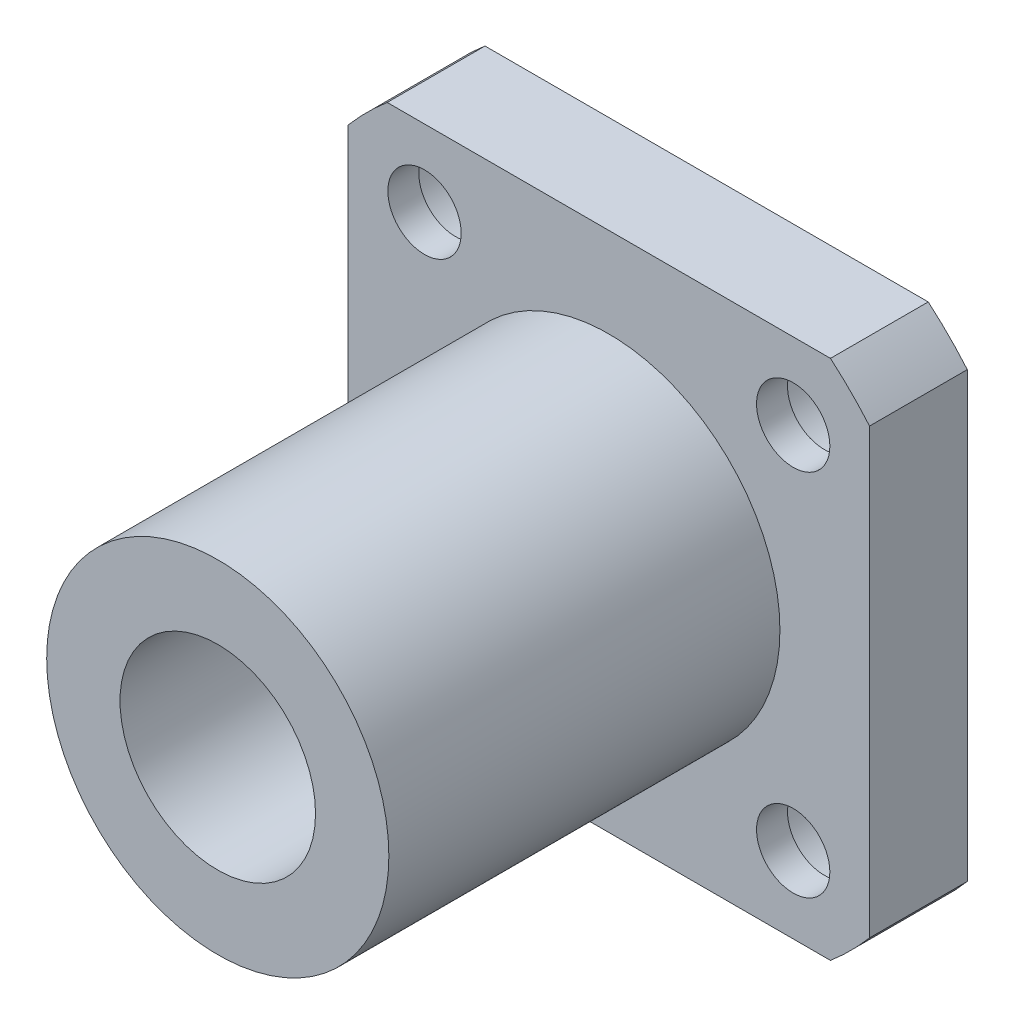
ISO-10303-21;
HEADER;
FILE_DESCRIPTION(('STEP AP214'),'2;1');
FILE_NAME('part.step','',(''),(''),'','','');
FILE_SCHEMA(('AUTOMOTIVE_DESIGN { 1 0 10303 214 1 1 1 1 }'));
ENDSEC;
DATA;
#1=APPLICATION_CONTEXT('core data for automotive mechanical design processes');
#2=APPLICATION_PROTOCOL_DEFINITION('international standard','automotive_design',2000,#1);
#3=PRODUCT_CONTEXT('',#1,'mechanical');
#4=PRODUCT('Part','Part','',(#3));
#5=PRODUCT_RELATED_PRODUCT_CATEGORY('part','',(#4));
#6=PRODUCT_DEFINITION_FORMATION('','',#4);
#7=PRODUCT_DEFINITION_CONTEXT('part definition',#1,'design');
#8=PRODUCT_DEFINITION('design','',#6,#7);
#9=PRODUCT_DEFINITION_SHAPE('','',#8);
#10=(LENGTH_UNIT() NAMED_UNIT(*) SI_UNIT(.MILLI.,.METRE.));
#11=(NAMED_UNIT(*) PLANE_ANGLE_UNIT() SI_UNIT($,.RADIAN.));
#12=(NAMED_UNIT(*) SI_UNIT($,.STERADIAN.) SOLID_ANGLE_UNIT());
#13=UNCERTAINTY_MEASURE_WITH_UNIT(LENGTH_MEASURE(1.E-05),#10,'distance_accuracy_value','');
#14=(GEOMETRIC_REPRESENTATION_CONTEXT(3) GLOBAL_UNCERTAINTY_ASSIGNED_CONTEXT((#13)) GLOBAL_UNIT_ASSIGNED_CONTEXT((#10,
#11,#12)) REPRESENTATION_CONTEXT('',''));
#15=CARTESIAN_POINT('',(0.,0.,0.));
#16=DIRECTION('',(0.,0.,1.));
#17=DIRECTION('',(1.,0.,0.));
#18=AXIS2_PLACEMENT_3D('',#15,#16,#17);
#19=CARTESIAN_POINT('',(0.,0.,6.));
#20=DIRECTION('',(0.,0.,1.));
#21=DIRECTION('',(1.,0.,0.));
#22=AXIS2_PLACEMENT_3D('',#19,#20,#21);
#23=PLANE('',#22);
#24=CARTESIAN_POINT('',(-11.3137084989848,-11.3137084989848,6.));
#25=DIRECTION('',(0.,0.,1.));
#26=DIRECTION('',(1.,0.,0.));
#27=AXIS2_PLACEMENT_3D('',#24,#25,#26);
#28=CIRCLE('',#27,2.25);
#29=CARTESIAN_POINT('',(-9.06370849898476,-11.3137084989848,6.));
#30=VERTEX_POINT('',#29);
#31=EDGE_CURVE('E205',#30,#30,#28,.T.);
#32=ORIENTED_EDGE('',*,*,#31,.F.);
#33=EDGE_LOOP('',(#32));
#34=FACE_BOUND('',#33,.T.);
#35=CARTESIAN_POINT('',(11.3137084989848,-11.3137084989847,6.));
#36=DIRECTION('',(0.,0.,1.));
#37=DIRECTION('',(1.,0.,0.));
#38=AXIS2_PLACEMENT_3D('',#35,#36,#37);
#39=CIRCLE('',#38,2.25);
#40=CARTESIAN_POINT('',(13.5637084989848,-11.3137084989847,6.));
#41=VERTEX_POINT('',#40);
#42=EDGE_CURVE('E202',#41,#41,#39,.T.);
#43=ORIENTED_EDGE('',*,*,#42,.F.);
#44=EDGE_LOOP('',(#43));
#45=FACE_BOUND('',#44,.T.);
#46=CARTESIAN_POINT('',(11.3137084989848,11.3137084989848,6.));
#47=DIRECTION('',(0.,0.,1.));
#48=DIRECTION('',(1.,0.,0.));
#49=AXIS2_PLACEMENT_3D('',#46,#47,#48);
#50=CIRCLE('',#49,2.25);
#51=CARTESIAN_POINT('',(13.5637084989848,11.3137084989848,6.));
#52=VERTEX_POINT('',#51);
#53=EDGE_CURVE('E199',#52,#52,#50,.T.);
#54=ORIENTED_EDGE('',*,*,#53,.F.);
#55=EDGE_LOOP('',(#54));
#56=FACE_BOUND('',#55,.T.);
#57=CARTESIAN_POINT('',(-11.3137084989848,11.3137084989847,6.));
#58=DIRECTION('',(0.,0.,1.));
#59=DIRECTION('',(1.,0.,0.));
#60=AXIS2_PLACEMENT_3D('',#57,#58,#59);
#61=CIRCLE('',#60,2.25);
#62=CARTESIAN_POINT('',(-9.06370849898478,11.3137084989847,6.));
#63=VERTEX_POINT('',#62);
#64=EDGE_CURVE('E194',#63,#63,#61,.T.);
#65=ORIENTED_EDGE('',*,*,#64,.F.);
#66=EDGE_LOOP('',(#65));
#67=FACE_BOUND('',#66,.T.);
#68=CARTESIAN_POINT('',(0.,0.,6.));
#69=DIRECTION('',(0.,0.,1.));
#70=DIRECTION('',(1.,0.,0.));
#71=AXIS2_PLACEMENT_3D('',#68,#69,#70);
#72=CIRCLE('',#71,21.);
#73=CARTESIAN_POINT('',(13.6014705087354,-16.,6.));
#74=VERTEX_POINT('',#73);
#75=CARTESIAN_POINT('',(16.,-13.6014705087354,6.));
#76=VERTEX_POINT('',#75);
#77=EDGE_CURVE('E152',#74,#76,#72,.T.);
#78=ORIENTED_EDGE('',*,*,#77,.T.);
#79=DIRECTION('',(0.,1.,0.));
#80=VECTOR('',#79,1.);
#81=CARTESIAN_POINT('',(16.,13.6014705087354,6.));
#82=LINE('',#81,#80);
#83=CARTESIAN_POINT('',(16.,13.6014705087354,6.));
#84=VERTEX_POINT('',#83);
#85=EDGE_CURVE('E100',#76,#84,#82,.T.);
#86=ORIENTED_EDGE('',*,*,#85,.T.);
#87=CARTESIAN_POINT('',(0.,0.,6.));
#88=DIRECTION('',(0.,0.,1.));
#89=DIRECTION('',(1.,0.,0.));
#90=AXIS2_PLACEMENT_3D('',#87,#88,#89);
#91=CIRCLE('',#90,21.);
#92=CARTESIAN_POINT('',(13.6014705087354,16.,6.));
#93=VERTEX_POINT('',#92);
#94=EDGE_CURVE('E167',#84,#93,#91,.T.);
#95=ORIENTED_EDGE('',*,*,#94,.T.);
#96=DIRECTION('',(-1.,0.,0.));
#97=VECTOR('',#96,1.);
#98=CARTESIAN_POINT('',(-13.6014705087354,16.,6.));
#99=LINE('',#98,#97);
#100=CARTESIAN_POINT('',(-13.6014705087354,16.,6.));
#101=VERTEX_POINT('',#100);
#102=EDGE_CURVE('E179',#93,#101,#99,.T.);
#103=ORIENTED_EDGE('',*,*,#102,.T.);
#104=CARTESIAN_POINT('',(0.,0.,6.));
#105=DIRECTION('',(0.,0.,1.));
#106=DIRECTION('',(1.,0.,0.));
#107=AXIS2_PLACEMENT_3D('',#104,#105,#106);
#108=CIRCLE('',#107,21.);
#109=CARTESIAN_POINT('',(-16.,13.6014705087354,6.));
#110=VERTEX_POINT('',#109);
#111=EDGE_CURVE('E119',#101,#110,#108,.T.);
#112=ORIENTED_EDGE('',*,*,#111,.T.);
#113=DIRECTION('',(0.,-1.,0.));
#114=VECTOR('',#113,1.);
#115=CARTESIAN_POINT('',(-16.,13.6014705087354,6.));
#116=LINE('',#115,#114);
#117=CARTESIAN_POINT('',(-16.,-13.6014705087355,6.));
#118=VERTEX_POINT('',#117);
#119=EDGE_CURVE('E113',#110,#118,#116,.T.);
#120=ORIENTED_EDGE('',*,*,#119,.T.);
#121=CARTESIAN_POINT('',(0.,0.,6.));
#122=DIRECTION('',(0.,0.,1.));
#123=DIRECTION('',(1.,0.,0.));
#124=AXIS2_PLACEMENT_3D('',#121,#122,#123);
#125=CIRCLE('',#124,21.);
#126=CARTESIAN_POINT('',(-13.6014705087355,-16.,6.));
#127=VERTEX_POINT('',#126);
#128=EDGE_CURVE('E117',#118,#127,#125,.T.);
#129=ORIENTED_EDGE('',*,*,#128,.T.);
#130=DIRECTION('',(1.,0.,0.));
#131=VECTOR('',#130,1.);
#132=CARTESIAN_POINT('',(-13.6014705087354,-16.,6.));
#133=LINE('',#132,#131);
#134=EDGE_CURVE('E57',#127,#74,#133,.T.);
#135=ORIENTED_EDGE('',*,*,#134,.T.);
#136=EDGE_LOOP('',(#78,#86,#95,#103,#112,#120,#129,#135));
#137=FACE_BOUND('',#136,.T.);
#138=CARTESIAN_POINT('',(0.,0.,6.));
#139=DIRECTION('',(0.,0.,1.));
#140=DIRECTION('',(1.,0.,0.));
#141=AXIS2_PLACEMENT_3D('',#138,#139,#140);
#142=CIRCLE('',#141,10.5);
#143=CARTESIAN_POINT('',(10.5,0.,6.));
#144=VERTEX_POINT('',#143);
#145=EDGE_CURVE('E185',#144,#144,#142,.T.);
#146=ORIENTED_EDGE('',*,*,#145,.F.);
#147=EDGE_LOOP('',(#146));
#148=FACE_BOUND('',#147,.T.);
#149=ADVANCED_FACE('F40',(#34,#45,#56,#67,#137,#148),#23,.T.);
#150=CARTESIAN_POINT('',(0.,0.,6.));
#151=DIRECTION('',(0.,0.,-1.));
#152=DIRECTION('',(-1.,0.,0.));
#153=AXIS2_PLACEMENT_3D('',#150,#151,#152);
#154=CYLINDRICAL_SURFACE('',#153,21.);
#155=CARTESIAN_POINT('',(0.,0.,0.));
#156=DIRECTION('',(0.,0.,1.));
#157=DIRECTION('',(1.,0.,0.));
#158=AXIS2_PLACEMENT_3D('',#155,#156,#157);
#159=CIRCLE('',#158,21.);
#160=CARTESIAN_POINT('',(13.6014705087354,-16.,0.));
#161=VERTEX_POINT('',#160);
#162=CARTESIAN_POINT('',(16.,-13.6014705087354,0.));
#163=VERTEX_POINT('',#162);
#164=EDGE_CURVE('E137',#161,#163,#159,.T.);
#165=ORIENTED_EDGE('',*,*,#164,.T.);
#166=DIRECTION('',(0.,0.,-1.));
#167=VECTOR('',#166,1.);
#168=CARTESIAN_POINT('',(16.,-13.6014705087354,6.));
#169=LINE('',#168,#167);
#170=EDGE_CURVE('E12',#76,#163,#169,.T.);
#171=ORIENTED_EDGE('',*,*,#170,.F.);
#172=ORIENTED_EDGE('',*,*,#77,.F.);
#173=DIRECTION('',(0.,0.,-1.));
#174=VECTOR('',#173,1.);
#175=CARTESIAN_POINT('',(13.6014705087354,-16.,6.));
#176=LINE('',#175,#174);
#177=EDGE_CURVE('E133',#74,#161,#176,.T.);
#178=ORIENTED_EDGE('',*,*,#177,.T.);
#179=EDGE_LOOP('',(#165,#171,#172,#178));
#180=FACE_BOUND('',#179,.T.);
#181=ADVANCED_FACE('F42',(#180),#154,.T.);
#182=CARTESIAN_POINT('',(16.,13.6014705087354,6.));
#183=DIRECTION('',(-1.,0.,0.));
#184=DIRECTION('',(0.,-1.,0.));
#185=AXIS2_PLACEMENT_3D('',#182,#183,#184);
#186=PLANE('',#185);
#187=DIRECTION('',(0.,1.,0.));
#188=VECTOR('',#187,1.);
#189=CARTESIAN_POINT('',(16.,13.6014705087354,0.));
#190=LINE('',#189,#188);
#191=CARTESIAN_POINT('',(16.,13.6014705087354,0.));
#192=VERTEX_POINT('',#191);
#193=EDGE_CURVE('E140',#163,#192,#190,.T.);
#194=ORIENTED_EDGE('',*,*,#193,.T.);
#195=DIRECTION('',(0.,0.,-1.));
#196=VECTOR('',#195,1.);
#197=CARTESIAN_POINT('',(16.,13.6014705087354,6.));
#198=LINE('',#197,#196);
#199=EDGE_CURVE('E49',#84,#192,#198,.T.);
#200=ORIENTED_EDGE('',*,*,#199,.F.);
#201=ORIENTED_EDGE('',*,*,#85,.F.);
#202=ORIENTED_EDGE('',*,*,#170,.T.);
#203=EDGE_LOOP('',(#194,#200,#201,#202));
#204=FACE_BOUND('',#203,.T.);
#205=ADVANCED_FACE('F315',(#204),#186,.F.);
#206=CARTESIAN_POINT('',(0.,0.,6.));
#207=DIRECTION('',(0.,0.,-1.));
#208=DIRECTION('',(-1.,0.,0.));
#209=AXIS2_PLACEMENT_3D('',#206,#207,#208);
#210=CYLINDRICAL_SURFACE('',#209,21.);
#211=CARTESIAN_POINT('',(0.,0.,0.));
#212=DIRECTION('',(0.,0.,1.));
#213=DIRECTION('',(1.,0.,0.));
#214=AXIS2_PLACEMENT_3D('',#211,#212,#213);
#215=CIRCLE('',#214,21.);
#216=CARTESIAN_POINT('',(13.6014705087354,16.,0.));
#217=VERTEX_POINT('',#216);
#218=EDGE_CURVE('E143',#192,#217,#215,.T.);
#219=ORIENTED_EDGE('',*,*,#218,.T.);
#220=DIRECTION('',(0.,0.,-1.));
#221=VECTOR('',#220,1.);
#222=CARTESIAN_POINT('',(13.6014705087354,16.,6.));
#223=LINE('',#222,#221);
#224=EDGE_CURVE('E159',#93,#217,#223,.T.);
#225=ORIENTED_EDGE('',*,*,#224,.F.);
#226=ORIENTED_EDGE('',*,*,#94,.F.);
#227=ORIENTED_EDGE('',*,*,#199,.T.);
#228=EDGE_LOOP('',(#219,#225,#226,#227));
#229=FACE_BOUND('',#228,.T.);
#230=ADVANCED_FACE('F165',(#229),#210,.T.);
#231=CARTESIAN_POINT('',(-13.6014705087354,16.,6.));
#232=DIRECTION('',(0.,-1.,0.));
#233=DIRECTION('',(0.,0.,-1.));
#234=AXIS2_PLACEMENT_3D('',#231,#232,#233);
#235=PLANE('',#234);
#236=DIRECTION('',(-1.,0.,0.));
#237=VECTOR('',#236,1.);
#238=CARTESIAN_POINT('',(-13.6014705087354,16.,0.));
#239=LINE('',#238,#237);
#240=CARTESIAN_POINT('',(-13.6014705087354,16.,0.));
#241=VERTEX_POINT('',#240);
#242=EDGE_CURVE('E145',#217,#241,#239,.T.);
#243=ORIENTED_EDGE('',*,*,#242,.T.);
#244=DIRECTION('',(0.,0.,-1.));
#245=VECTOR('',#244,1.);
#246=CARTESIAN_POINT('',(-13.6014705087354,16.,6.));
#247=LINE('',#246,#245);
#248=EDGE_CURVE('E156',#101,#241,#247,.T.);
#249=ORIENTED_EDGE('',*,*,#248,.F.);
#250=ORIENTED_EDGE('',*,*,#102,.F.);
#251=ORIENTED_EDGE('',*,*,#224,.T.);
#252=EDGE_LOOP('',(#243,#249,#250,#251));
#253=FACE_BOUND('',#252,.T.);
#254=ADVANCED_FACE('F175',(#253),#235,.F.);
#255=CARTESIAN_POINT('',(0.,0.,6.));
#256=DIRECTION('',(0.,0.,-1.));
#257=DIRECTION('',(-1.,0.,0.));
#258=AXIS2_PLACEMENT_3D('',#255,#256,#257);
#259=CYLINDRICAL_SURFACE('',#258,21.);
#260=CARTESIAN_POINT('',(0.,0.,0.));
#261=DIRECTION('',(0.,0.,1.));
#262=DIRECTION('',(1.,0.,0.));
#263=AXIS2_PLACEMENT_3D('',#260,#261,#262);
#264=CIRCLE('',#263,21.);
#265=CARTESIAN_POINT('',(-16.,13.6014705087354,0.));
#266=VERTEX_POINT('',#265);
#267=EDGE_CURVE('E147',#241,#266,#264,.T.);
#268=ORIENTED_EDGE('',*,*,#267,.T.);
#269=DIRECTION('',(0.,0.,-1.));
#270=VECTOR('',#269,1.);
#271=CARTESIAN_POINT('',(-16.,13.6014705087354,6.));
#272=LINE('',#271,#270);
#273=EDGE_CURVE('E128',#110,#266,#272,.T.);
#274=ORIENTED_EDGE('',*,*,#273,.F.);
#275=ORIENTED_EDGE('',*,*,#111,.F.);
#276=ORIENTED_EDGE('',*,*,#248,.T.);
#277=EDGE_LOOP('',(#268,#274,#275,#276));
#278=FACE_BOUND('',#277,.T.);
#279=ADVANCED_FACE('F178',(#278),#259,.T.);
#280=CARTESIAN_POINT('',(-16.,13.6014705087354,6.));
#281=DIRECTION('',(1.,0.,0.));
#282=DIRECTION('',(0.,1.,0.));
#283=AXIS2_PLACEMENT_3D('',#280,#281,#282);
#284=PLANE('',#283);
#285=DIRECTION('',(0.,-1.,0.));
#286=VECTOR('',#285,1.);
#287=CARTESIAN_POINT('',(-16.,13.6014705087354,0.));
#288=LINE('',#287,#286);
#289=CARTESIAN_POINT('',(-16.,-13.6014705087355,0.));
#290=VERTEX_POINT('',#289);
#291=EDGE_CURVE('E127',#266,#290,#288,.T.);
#292=ORIENTED_EDGE('',*,*,#291,.T.);
#293=DIRECTION('',(0.,0.,-1.));
#294=VECTOR('',#293,1.);
#295=CARTESIAN_POINT('',(-16.,-13.6014705087355,6.));
#296=LINE('',#295,#294);
#297=EDGE_CURVE('E124',#118,#290,#296,.T.);
#298=ORIENTED_EDGE('',*,*,#297,.F.);
#299=ORIENTED_EDGE('',*,*,#119,.F.);
#300=ORIENTED_EDGE('',*,*,#273,.T.);
#301=EDGE_LOOP('',(#292,#298,#299,#300));
#302=FACE_BOUND('',#301,.T.);
#303=ADVANCED_FACE('F125',(#302),#284,.F.);
#304=CARTESIAN_POINT('',(0.,0.,6.));
#305=DIRECTION('',(0.,0.,-1.));
#306=DIRECTION('',(-1.,0.,0.));
#307=AXIS2_PLACEMENT_3D('',#304,#305,#306);
#308=CYLINDRICAL_SURFACE('',#307,21.);
#309=CARTESIAN_POINT('',(0.,0.,0.));
#310=DIRECTION('',(0.,0.,1.));
#311=DIRECTION('',(1.,0.,0.));
#312=AXIS2_PLACEMENT_3D('',#309,#310,#311);
#313=CIRCLE('',#312,21.);
#314=CARTESIAN_POINT('',(-13.6014705087355,-16.,0.));
#315=VERTEX_POINT('',#314);
#316=EDGE_CURVE('E86',#290,#315,#313,.T.);
#317=ORIENTED_EDGE('',*,*,#316,.T.);
#318=DIRECTION('',(0.,0.,-1.));
#319=VECTOR('',#318,1.);
#320=CARTESIAN_POINT('',(-13.6014705087355,-16.,6.));
#321=LINE('',#320,#319);
#322=EDGE_CURVE('E129',#127,#315,#321,.T.);
#323=ORIENTED_EDGE('',*,*,#322,.F.);
#324=ORIENTED_EDGE('',*,*,#128,.F.);
#325=ORIENTED_EDGE('',*,*,#297,.T.);
#326=EDGE_LOOP('',(#317,#323,#324,#325));
#327=FACE_BOUND('',#326,.T.);
#328=ADVANCED_FACE('F131',(#327),#308,.T.);
#329=CARTESIAN_POINT('',(-13.6014705087354,-16.,6.));
#330=DIRECTION('',(0.,1.,0.));
#331=DIRECTION('',(0.,0.,1.));
#332=AXIS2_PLACEMENT_3D('',#329,#330,#331);
#333=PLANE('',#332);
#334=DIRECTION('',(1.,0.,0.));
#335=VECTOR('',#334,1.);
#336=CARTESIAN_POINT('',(-13.6014705087354,-16.,0.));
#337=LINE('',#336,#335);
#338=EDGE_CURVE('E92',#315,#161,#337,.T.);
#339=ORIENTED_EDGE('',*,*,#338,.T.);
#340=ORIENTED_EDGE('',*,*,#177,.F.);
#341=ORIENTED_EDGE('',*,*,#134,.F.);
#342=ORIENTED_EDGE('',*,*,#322,.T.);
#343=EDGE_LOOP('',(#339,#340,#341,#342));
#344=FACE_BOUND('',#343,.T.);
#345=ADVANCED_FACE('F303',(#344),#333,.F.);
#346=CARTESIAN_POINT('',(0.,0.,0.));
#347=DIRECTION('',(0.,0.,1.));
#348=DIRECTION('',(1.,0.,0.));
#349=AXIS2_PLACEMENT_3D('',#346,#347,#348);
#350=PLANE('',#349);
#351=CARTESIAN_POINT('',(-11.3137084989848,-11.3137084989848,0.));
#352=DIRECTION('',(0.,0.,1.));
#353=DIRECTION('',(1.,0.,0.));
#354=AXIS2_PLACEMENT_3D('',#351,#352,#353);
#355=CIRCLE('',#354,3.75);
#356=CARTESIAN_POINT('',(-7.56370849898476,-11.3137084989848,0.));
#357=VERTEX_POINT('',#356);
#358=EDGE_CURVE('E238',#357,#357,#355,.T.);
#359=ORIENTED_EDGE('',*,*,#358,.T.);
#360=EDGE_LOOP('',(#359));
#361=FACE_BOUND('',#360,.T.);
#362=CARTESIAN_POINT('',(11.3137084989848,-11.3137084989847,0.));
#363=DIRECTION('',(0.,0.,1.));
#364=DIRECTION('',(1.,0.,0.));
#365=AXIS2_PLACEMENT_3D('',#362,#363,#364);
#366=CIRCLE('',#365,3.75);
#367=CARTESIAN_POINT('',(15.0637084989848,-11.3137084989847,0.));
#368=VERTEX_POINT('',#367);
#369=EDGE_CURVE('E229',#368,#368,#366,.T.);
#370=ORIENTED_EDGE('',*,*,#369,.T.);
#371=EDGE_LOOP('',(#370));
#372=FACE_BOUND('',#371,.T.);
#373=CARTESIAN_POINT('',(11.3137084989848,11.3137084989848,0.));
#374=DIRECTION('',(0.,0.,1.));
#375=DIRECTION('',(1.,0.,0.));
#376=AXIS2_PLACEMENT_3D('',#373,#374,#375);
#377=CIRCLE('',#376,3.75);
#378=CARTESIAN_POINT('',(15.0637084989848,11.3137084989848,0.));
#379=VERTEX_POINT('',#378);
#380=EDGE_CURVE('E220',#379,#379,#377,.T.);
#381=ORIENTED_EDGE('',*,*,#380,.T.);
#382=EDGE_LOOP('',(#381));
#383=FACE_BOUND('',#382,.T.);
#384=CARTESIAN_POINT('',(-11.3137084989848,11.3137084989847,0.));
#385=DIRECTION('',(0.,0.,1.));
#386=DIRECTION('',(1.,0.,0.));
#387=AXIS2_PLACEMENT_3D('',#384,#385,#386);
#388=CIRCLE('',#387,3.75);
#389=CARTESIAN_POINT('',(-7.56370849898478,11.3137084989847,0.));
#390=VERTEX_POINT('',#389);
#391=EDGE_CURVE('E211',#390,#390,#388,.T.);
#392=ORIENTED_EDGE('',*,*,#391,.T.);
#393=EDGE_LOOP('',(#392));
#394=FACE_BOUND('',#393,.T.);
#395=CARTESIAN_POINT('',(0.,0.,0.));
#396=DIRECTION('',(0.,0.,1.));
#397=DIRECTION('',(1.,0.,0.));
#398=AXIS2_PLACEMENT_3D('',#395,#396,#397);
#399=CIRCLE('',#398,6.);
#400=CARTESIAN_POINT('',(6.,0.,0.));
#401=VERTEX_POINT('',#400);
#402=EDGE_CURVE('E188',#401,#401,#399,.T.);
#403=ORIENTED_EDGE('',*,*,#402,.T.);
#404=EDGE_LOOP('',(#403));
#405=FACE_BOUND('',#404,.T.);
#406=ORIENTED_EDGE('',*,*,#164,.F.);
#407=ORIENTED_EDGE('',*,*,#338,.F.);
#408=ORIENTED_EDGE('',*,*,#316,.F.);
#409=ORIENTED_EDGE('',*,*,#291,.F.);
#410=ORIENTED_EDGE('',*,*,#267,.F.);
#411=ORIENTED_EDGE('',*,*,#242,.F.);
#412=ORIENTED_EDGE('',*,*,#218,.F.);
#413=ORIENTED_EDGE('',*,*,#193,.F.);
#414=EDGE_LOOP('',(#406,#407,#408,#409,#410,#411,#412,#413));
#415=FACE_BOUND('',#414,.T.);
#416=ADVANCED_FACE('F171',(#361,#372,#383,#394,#405,#415),#350,.F.);
#417=CARTESIAN_POINT('',(0.,0.,30.));
#418=DIRECTION('',(0.,0.,-1.));
#419=DIRECTION('',(-1.,0.,0.));
#420=AXIS2_PLACEMENT_3D('',#417,#418,#419);
#421=CYLINDRICAL_SURFACE('',#420,10.5);
#422=CARTESIAN_POINT('',(0.,0.,30.));
#423=DIRECTION('',(0.,0.,1.));
#424=DIRECTION('',(1.,0.,0.));
#425=AXIS2_PLACEMENT_3D('',#422,#423,#424);
#426=CIRCLE('',#425,10.5);
#427=CARTESIAN_POINT('',(10.5,0.,30.));
#428=VERTEX_POINT('',#427);
#429=EDGE_CURVE('E141',#428,#428,#426,.T.);
#430=ORIENTED_EDGE('',*,*,#429,.F.);
#431=EDGE_LOOP('',(#430));
#432=FACE_BOUND('',#431,.T.);
#433=ORIENTED_EDGE('',*,*,#145,.T.);
#434=EDGE_LOOP('',(#433));
#435=FACE_BOUND('',#434,.T.);
#436=ADVANCED_FACE('F296',(#432,#435),#421,.T.);
#437=CARTESIAN_POINT('',(0.,0.,30.));
#438=DIRECTION('',(0.,0.,1.));
#439=DIRECTION('',(1.,0.,0.));
#440=AXIS2_PLACEMENT_3D('',#437,#438,#439);
#441=PLANE('',#440);
#442=CARTESIAN_POINT('',(0.,0.,30.));
#443=DIRECTION('',(0.,0.,1.));
#444=DIRECTION('',(1.,0.,0.));
#445=AXIS2_PLACEMENT_3D('',#442,#443,#444);
#446=CIRCLE('',#445,6.);
#447=CARTESIAN_POINT('',(6.,0.,30.));
#448=VERTEX_POINT('',#447);
#449=EDGE_CURVE('E191',#448,#448,#446,.T.);
#450=ORIENTED_EDGE('',*,*,#449,.F.);
#451=EDGE_LOOP('',(#450));
#452=FACE_BOUND('',#451,.T.);
#453=ORIENTED_EDGE('',*,*,#429,.T.);
#454=EDGE_LOOP('',(#453));
#455=FACE_BOUND('',#454,.T.);
#456=ADVANCED_FACE('F289',(#452,#455),#441,.T.);
#457=CARTESIAN_POINT('',(0.,0.,0.));
#458=DIRECTION('',(0.,0.,1.));
#459=DIRECTION('',(1.,0.,0.));
#460=AXIS2_PLACEMENT_3D('',#457,#458,#459);
#461=CYLINDRICAL_SURFACE('',#460,6.);
#462=ORIENTED_EDGE('',*,*,#402,.F.);
#463=EDGE_LOOP('',(#462));
#464=FACE_BOUND('',#463,.T.);
#465=ORIENTED_EDGE('',*,*,#449,.T.);
#466=EDGE_LOOP('',(#465));
#467=FACE_BOUND('',#466,.T.);
#468=ADVANCED_FACE('F280',(#464,#467),#461,.F.);
#469=CARTESIAN_POINT('',(-11.3137084989848,11.3137084989847,4.1));
#470=DIRECTION('',(0.,0.,1.));
#471=DIRECTION('',(1.,0.,0.));
#472=AXIS2_PLACEMENT_3D('',#469,#470,#471);
#473=CYLINDRICAL_SURFACE('',#472,2.25);
#474=CARTESIAN_POINT('',(-11.3137084989848,11.3137084989847,4.1));
#475=DIRECTION('',(0.,0.,1.));
#476=DIRECTION('',(1.,0.,0.));
#477=AXIS2_PLACEMENT_3D('',#474,#475,#476);
#478=CIRCLE('',#477,2.25);
#479=CARTESIAN_POINT('',(-9.06370849898478,11.3137084989847,4.1));
#480=VERTEX_POINT('',#479);
#481=EDGE_CURVE('E208',#480,#480,#478,.F.);
#482=ORIENTED_EDGE('',*,*,#481,.T.);
#483=EDGE_LOOP('',(#482));
#484=FACE_BOUND('',#483,.T.);
#485=ORIENTED_EDGE('',*,*,#64,.T.);
#486=EDGE_LOOP('',(#485));
#487=FACE_BOUND('',#486,.T.);
#488=ADVANCED_FACE('F277',(#484,#487),#473,.F.);
#489=CARTESIAN_POINT('',(11.3137084989848,11.3137084989848,4.1));
#490=DIRECTION('',(0.,0.,1.));
#491=DIRECTION('',(1.,0.,0.));
#492=AXIS2_PLACEMENT_3D('',#489,#490,#491);
#493=CYLINDRICAL_SURFACE('',#492,2.25);
#494=CARTESIAN_POINT('',(11.3137084989848,11.3137084989848,4.1));
#495=DIRECTION('',(0.,0.,1.));
#496=DIRECTION('',(1.,0.,0.));
#497=AXIS2_PLACEMENT_3D('',#494,#495,#496);
#498=CIRCLE('',#497,2.25);
#499=CARTESIAN_POINT('',(13.5637084989848,11.3137084989848,4.1));
#500=VERTEX_POINT('',#499);
#501=EDGE_CURVE('E215',#500,#500,#498,.F.);
#502=ORIENTED_EDGE('',*,*,#501,.T.);
#503=EDGE_LOOP('',(#502));
#504=FACE_BOUND('',#503,.T.);
#505=ORIENTED_EDGE('',*,*,#53,.T.);
#506=EDGE_LOOP('',(#505));
#507=FACE_BOUND('',#506,.T.);
#508=ADVANCED_FACE('F279',(#504,#507),#493,.F.);
#509=CARTESIAN_POINT('',(11.3137084989848,-11.3137084989847,4.1));
#510=DIRECTION('',(0.,0.,1.));
#511=DIRECTION('',(1.,0.,0.));
#512=AXIS2_PLACEMENT_3D('',#509,#510,#511);
#513=CYLINDRICAL_SURFACE('',#512,2.25);
#514=CARTESIAN_POINT('',(11.3137084989848,-11.3137084989847,4.1));
#515=DIRECTION('',(0.,0.,1.));
#516=DIRECTION('',(1.,0.,0.));
#517=AXIS2_PLACEMENT_3D('',#514,#515,#516);
#518=CIRCLE('',#517,2.25);
#519=CARTESIAN_POINT('',(13.5637084989848,-11.3137084989847,4.1));
#520=VERTEX_POINT('',#519);
#521=EDGE_CURVE('E224',#520,#520,#518,.F.);
#522=ORIENTED_EDGE('',*,*,#521,.T.);
#523=EDGE_LOOP('',(#522));
#524=FACE_BOUND('',#523,.T.);
#525=ORIENTED_EDGE('',*,*,#42,.T.);
#526=EDGE_LOOP('',(#525));
#527=FACE_BOUND('',#526,.T.);
#528=ADVANCED_FACE('F264',(#524,#527),#513,.F.);
#529=CARTESIAN_POINT('',(-11.3137084989848,-11.3137084989848,4.1));
#530=DIRECTION('',(0.,0.,1.));
#531=DIRECTION('',(1.,0.,0.));
#532=AXIS2_PLACEMENT_3D('',#529,#530,#531);
#533=CYLINDRICAL_SURFACE('',#532,2.25);
#534=CARTESIAN_POINT('',(-11.3137084989848,-11.3137084989848,4.1));
#535=DIRECTION('',(0.,0.,1.));
#536=DIRECTION('',(1.,0.,0.));
#537=AXIS2_PLACEMENT_3D('',#534,#535,#536);
#538=CIRCLE('',#537,2.25);
#539=CARTESIAN_POINT('',(-9.06370849898476,-11.3137084989848,4.1));
#540=VERTEX_POINT('',#539);
#541=EDGE_CURVE('E233',#540,#540,#538,.F.);
#542=ORIENTED_EDGE('',*,*,#541,.T.);
#543=EDGE_LOOP('',(#542));
#544=FACE_BOUND('',#543,.T.);
#545=ORIENTED_EDGE('',*,*,#31,.T.);
#546=EDGE_LOOP('',(#545));
#547=FACE_BOUND('',#546,.T.);
#548=ADVANCED_FACE('F260',(#544,#547),#533,.F.);
#549=CARTESIAN_POINT('',(-11.3137084989848,11.3137084989847,4.1));
#550=DIRECTION('',(0.,0.,1.));
#551=DIRECTION('',(1.,0.,0.));
#552=AXIS2_PLACEMENT_3D('',#549,#550,#551);
#553=PLANE('',#552);
#554=CARTESIAN_POINT('',(-11.3137084989848,11.3137084989847,4.1));
#555=DIRECTION('',(0.,0.,1.));
#556=DIRECTION('',(1.,0.,0.));
#557=AXIS2_PLACEMENT_3D('',#554,#555,#556);
#558=CIRCLE('',#557,3.75);
#559=CARTESIAN_POINT('',(-7.56370849898478,11.3137084989847,4.1));
#560=VERTEX_POINT('',#559);
#561=EDGE_CURVE('E212',#560,#560,#558,.T.);
#562=ORIENTED_EDGE('',*,*,#561,.F.);
#563=EDGE_LOOP('',(#562));
#564=FACE_BOUND('',#563,.T.);
#565=ORIENTED_EDGE('',*,*,#481,.F.);
#566=EDGE_LOOP('',(#565));
#567=FACE_BOUND('',#566,.T.);
#568=ADVANCED_FACE('F263',(#564,#567),#553,.F.);
#569=CARTESIAN_POINT('',(-11.3137084989848,11.3137084989847,0.));
#570=DIRECTION('',(0.,0.,1.));
#571=DIRECTION('',(1.,0.,0.));
#572=AXIS2_PLACEMENT_3D('',#569,#570,#571);
#573=CYLINDRICAL_SURFACE('',#572,3.75);
#574=ORIENTED_EDGE('',*,*,#391,.F.);
#575=EDGE_LOOP('',(#574));
#576=FACE_BOUND('',#575,.T.);
#577=ORIENTED_EDGE('',*,*,#561,.T.);
#578=EDGE_LOOP('',(#577));
#579=FACE_BOUND('',#578,.T.);
#580=ADVANCED_FACE('F374',(#576,#579),#573,.F.);
#581=CARTESIAN_POINT('',(11.3137084989848,11.3137084989848,4.1));
#582=DIRECTION('',(0.,0.,1.));
#583=DIRECTION('',(1.,0.,0.));
#584=AXIS2_PLACEMENT_3D('',#581,#582,#583);
#585=PLANE('',#584);
#586=CARTESIAN_POINT('',(11.3137084989848,11.3137084989848,4.1));
#587=DIRECTION('',(0.,0.,1.));
#588=DIRECTION('',(1.,0.,0.));
#589=AXIS2_PLACEMENT_3D('',#586,#587,#588);
#590=CIRCLE('',#589,3.75);
#591=CARTESIAN_POINT('',(15.0637084989848,11.3137084989848,4.1));
#592=VERTEX_POINT('',#591);
#593=EDGE_CURVE('E221',#592,#592,#590,.T.);
#594=ORIENTED_EDGE('',*,*,#593,.F.);
#595=EDGE_LOOP('',(#594));
#596=FACE_BOUND('',#595,.T.);
#597=ORIENTED_EDGE('',*,*,#501,.F.);
#598=EDGE_LOOP('',(#597));
#599=FACE_BOUND('',#598,.T.);
#600=ADVANCED_FACE('F384',(#596,#599),#585,.F.);
#601=CARTESIAN_POINT('',(11.3137084989848,11.3137084989848,0.));
#602=DIRECTION('',(0.,0.,1.));
#603=DIRECTION('',(1.,0.,0.));
#604=AXIS2_PLACEMENT_3D('',#601,#602,#603);
#605=CYLINDRICAL_SURFACE('',#604,3.75);
#606=ORIENTED_EDGE('',*,*,#380,.F.);
#607=EDGE_LOOP('',(#606));
#608=FACE_BOUND('',#607,.T.);
#609=ORIENTED_EDGE('',*,*,#593,.T.);
#610=EDGE_LOOP('',(#609));
#611=FACE_BOUND('',#610,.T.);
#612=ADVANCED_FACE('F394',(#608,#611),#605,.F.);
#613=CARTESIAN_POINT('',(11.3137084989848,-11.3137084989847,4.1));
#614=DIRECTION('',(0.,0.,1.));
#615=DIRECTION('',(1.,0.,0.));
#616=AXIS2_PLACEMENT_3D('',#613,#614,#615);
#617=PLANE('',#616);
#618=CARTESIAN_POINT('',(11.3137084989848,-11.3137084989847,4.1));
#619=DIRECTION('',(0.,0.,1.));
#620=DIRECTION('',(1.,0.,0.));
#621=AXIS2_PLACEMENT_3D('',#618,#619,#620);
#622=CIRCLE('',#621,3.75);
#623=CARTESIAN_POINT('',(15.0637084989848,-11.3137084989847,4.1));
#624=VERTEX_POINT('',#623);
#625=EDGE_CURVE('E230',#624,#624,#622,.T.);
#626=ORIENTED_EDGE('',*,*,#625,.F.);
#627=EDGE_LOOP('',(#626));
#628=FACE_BOUND('',#627,.T.);
#629=ORIENTED_EDGE('',*,*,#521,.F.);
#630=EDGE_LOOP('',(#629));
#631=FACE_BOUND('',#630,.T.);
#632=ADVANCED_FACE('F404',(#628,#631),#617,.F.);
#633=CARTESIAN_POINT('',(11.3137084989848,-11.3137084989847,0.));
#634=DIRECTION('',(0.,0.,1.));
#635=DIRECTION('',(1.,0.,0.));
#636=AXIS2_PLACEMENT_3D('',#633,#634,#635);
#637=CYLINDRICAL_SURFACE('',#636,3.75);
#638=ORIENTED_EDGE('',*,*,#369,.F.);
#639=EDGE_LOOP('',(#638));
#640=FACE_BOUND('',#639,.T.);
#641=ORIENTED_EDGE('',*,*,#625,.T.);
#642=EDGE_LOOP('',(#641));
#643=FACE_BOUND('',#642,.T.);
#644=ADVANCED_FACE('F256',(#640,#643),#637,.F.);
#645=CARTESIAN_POINT('',(-11.3137084989848,-11.3137084989848,4.1));
#646=DIRECTION('',(0.,0.,1.));
#647=DIRECTION('',(1.,0.,0.));
#648=AXIS2_PLACEMENT_3D('',#645,#646,#647);
#649=PLANE('',#648);
#650=CARTESIAN_POINT('',(-11.3137084989848,-11.3137084989848,4.1));
#651=DIRECTION('',(0.,0.,1.));
#652=DIRECTION('',(1.,0.,0.));
#653=AXIS2_PLACEMENT_3D('',#650,#651,#652);
#654=CIRCLE('',#653,3.75);
#655=CARTESIAN_POINT('',(-7.56370849898476,-11.3137084989848,4.1));
#656=VERTEX_POINT('',#655);
#657=EDGE_CURVE('E239',#656,#656,#654,.T.);
#658=ORIENTED_EDGE('',*,*,#657,.F.);
#659=EDGE_LOOP('',(#658));
#660=FACE_BOUND('',#659,.T.);
#661=ORIENTED_EDGE('',*,*,#541,.F.);
#662=EDGE_LOOP('',(#661));
#663=FACE_BOUND('',#662,.T.);
#664=ADVANCED_FACE('F250',(#660,#663),#649,.F.);
#665=CARTESIAN_POINT('',(-11.3137084989848,-11.3137084989848,0.));
#666=DIRECTION('',(0.,0.,1.));
#667=DIRECTION('',(1.,0.,0.));
#668=AXIS2_PLACEMENT_3D('',#665,#666,#667);
#669=CYLINDRICAL_SURFACE('',#668,3.75);
#670=ORIENTED_EDGE('',*,*,#358,.F.);
#671=EDGE_LOOP('',(#670));
#672=FACE_BOUND('',#671,.T.);
#673=ORIENTED_EDGE('',*,*,#657,.T.);
#674=EDGE_LOOP('',(#673));
#675=FACE_BOUND('',#674,.T.);
#676=ADVANCED_FACE('F247',(#672,#675),#669,.F.);
#677=CLOSED_SHELL('',(#149,#181,#205,#230,#254,#279,#303,#328,#345,#416,#436,#456,#468,#488,
#508,#528,#548,#568,#580,#600,#612,#632,#644,#664,#676));
#678=MANIFOLD_SOLID_BREP('B2',#677);
#679=ADVANCED_BREP_SHAPE_REPRESENTATION('',(#18,#678),#14);
#680=SHAPE_DEFINITION_REPRESENTATION(#9,#679);
ENDSEC;
END-ISO-10303-21;
